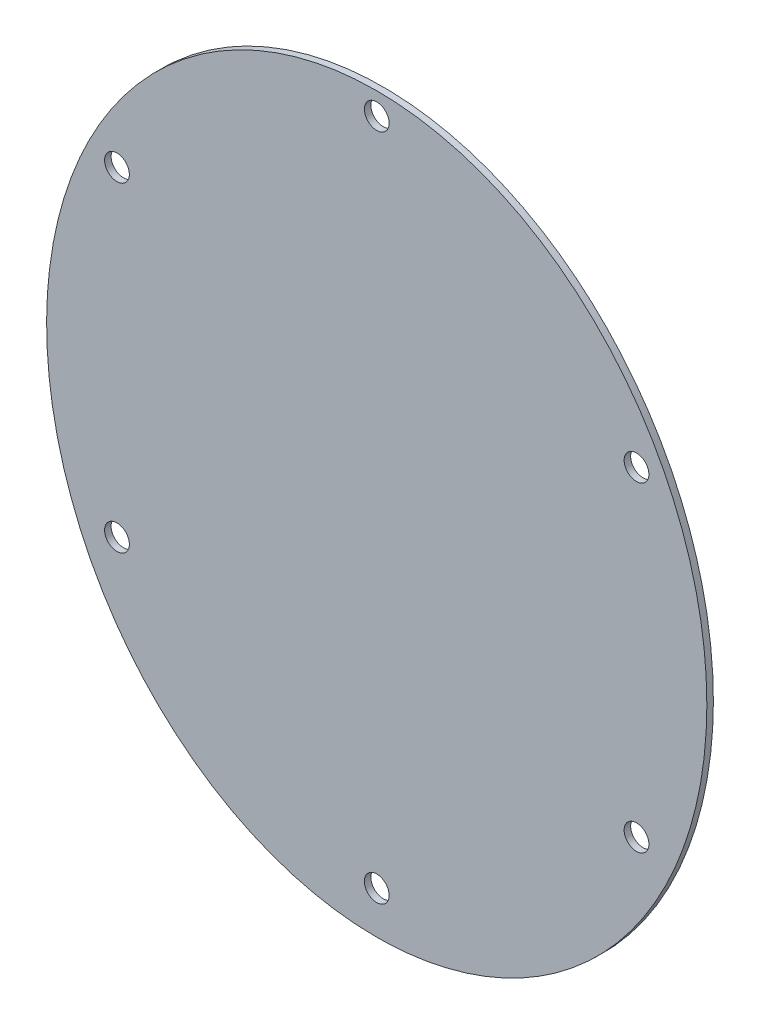
ISO-10303-21;
HEADER;
FILE_DESCRIPTION(('STEP AP214'),'2;1');
FILE_NAME('part.step','',(''),(''),'','','');
FILE_SCHEMA(('AUTOMOTIVE_DESIGN { 1 0 10303 214 1 1 1 1 }'));
ENDSEC;
DATA;
#1=APPLICATION_CONTEXT('core data for automotive mechanical design processes');
#2=APPLICATION_PROTOCOL_DEFINITION('international standard','automotive_design',2000,#1);
#3=PRODUCT_CONTEXT('',#1,'mechanical');
#4=PRODUCT('Part','Part','',(#3));
#5=PRODUCT_RELATED_PRODUCT_CATEGORY('part','',(#4));
#6=PRODUCT_DEFINITION_FORMATION('','',#4);
#7=PRODUCT_DEFINITION_CONTEXT('part definition',#1,'design');
#8=PRODUCT_DEFINITION('design','',#6,#7);
#9=PRODUCT_DEFINITION_SHAPE('','',#8);
#10=(LENGTH_UNIT() NAMED_UNIT(*) SI_UNIT(.MILLI.,.METRE.));
#11=(NAMED_UNIT(*) PLANE_ANGLE_UNIT() SI_UNIT($,.RADIAN.));
#12=(NAMED_UNIT(*) SI_UNIT($,.STERADIAN.) SOLID_ANGLE_UNIT());
#13=UNCERTAINTY_MEASURE_WITH_UNIT(LENGTH_MEASURE(1.E-05),#10,'distance_accuracy_value','');
#14=(GEOMETRIC_REPRESENTATION_CONTEXT(3) GLOBAL_UNCERTAINTY_ASSIGNED_CONTEXT((#13)) GLOBAL_UNIT_ASSIGNED_CONTEXT((#10,
#11,#12)) REPRESENTATION_CONTEXT('',''));
#15=CARTESIAN_POINT('',(0.,0.,0.));
#16=DIRECTION('',(0.,0.,1.));
#17=DIRECTION('',(1.,0.,0.));
#18=AXIS2_PLACEMENT_3D('',#15,#16,#17);
#19=CARTESIAN_POINT('',(0.196552246439251,52.9202516701964,1.));
#20=DIRECTION('',(0.,0.,-1.));
#21=DIRECTION('',(-1.,0.,0.));
#22=AXIS2_PLACEMENT_3D('',#19,#20,#21);
#23=PLANE('',#22);
#24=CARTESIAN_POINT('',(39.8371685740842,22.8280933576828,1.));
#25=DIRECTION('',(0.,0.,1.));
#26=DIRECTION('',(1.,0.,0.));
#27=AXIS2_PLACEMENT_3D('',#24,#25,#26);
#28=CIRCLE('',#27,1.89864999999999);
#29=CARTESIAN_POINT('',(41.7358185740842,22.8280933576828,1.));
#30=VERTEX_POINT('',#29);
#31=EDGE_CURVE('E77',#30,#30,#28,.T.);
#32=ORIENTED_EDGE('',*,*,#31,.F.);
#33=EDGE_LOOP('',(#32));
#34=FACE_BOUND('',#33,.T.);
#35=CARTESIAN_POINT('',(-39.8371685740842,-26.2921949728195,1.));
#36=DIRECTION('',(0.,0.,1.));
#37=DIRECTION('',(1.,0.,0.));
#38=AXIS2_PLACEMENT_3D('',#35,#36,#37);
#39=CIRCLE('',#38,1.89864999999999);
#40=CARTESIAN_POINT('',(-37.9385185740842,-26.2921949728195,1.));
#41=VERTEX_POINT('',#40);
#42=EDGE_CURVE('E71',#41,#41,#39,.T.);
#43=ORIENTED_EDGE('',*,*,#42,.F.);
#44=EDGE_LOOP('',(#43));
#45=FACE_BOUND('',#44,.T.);
#46=CARTESIAN_POINT('',(39.8371685740842,-26.2921949728195,1.));
#47=DIRECTION('',(0.,0.,1.));
#48=DIRECTION('',(1.,0.,0.));
#49=AXIS2_PLACEMENT_3D('',#46,#47,#48);
#50=CIRCLE('',#49,1.89864999999999);
#51=CARTESIAN_POINT('',(41.7358185740842,-26.2921949728195,1.));
#52=VERTEX_POINT('',#51);
#53=EDGE_CURVE('E53',#52,#52,#50,.T.);
#54=ORIENTED_EDGE('',*,*,#53,.F.);
#55=EDGE_LOOP('',(#54));
#56=FACE_BOUND('',#55,.T.);
#57=CARTESIAN_POINT('',(-0.0982194783628874,-59.5049604957268,1.));
#58=CARTESIAN_POINT('',(-0.981998738313389,-59.5030569990498,1.));
#59=CARTESIAN_POINT('',(-1.86634986060419,-59.4753922800616,1.));
#60=CARTESIAN_POINT('',(-3.62681671010795,-59.3691952722465,1.));
#61=CARTESIAN_POINT('',(-4.50450795032884,-59.290677090925,1.));
#62=CARTESIAN_POINT('',(-6.25482812899365,-59.0830220274894,1.));
#63=CARTESIAN_POINT('',(-7.12746263210783,-58.9539407873324,1.));
#64=CARTESIAN_POINT('',(-8.86764039021307,-58.6448701674466,1.));
#65=CARTESIAN_POINT('',(-9.73556333289851,-58.4646041765763,1.));
#66=CARTESIAN_POINT('',(-14.0154658104592,-57.4481518059426,1.));
#67=CARTESIAN_POINT('',(-17.288093173818,-56.262961800742,1.));
#68=CARTESIAN_POINT('',(-21.9851942406638,-53.9642697896704,1.));
#69=CARTESIAN_POINT('',(-23.5152979816951,-53.1105083048384,1.));
#70=CARTESIAN_POINT('',(-25.756352373327,-51.6968330940162,1.));
#71=CARTESIAN_POINT('',(-26.4907922652201,-51.2055327801085,1.));
#72=CARTESIAN_POINT('',(-27.9238784274983,-50.1915506671955,1.));
#73=CARTESIAN_POINT('',(-28.6243327805825,-49.6677443153114,1.));
#74=CARTESIAN_POINT('',(-32.0492001655399,-46.9678125916154,1.));
#75=CARTESIAN_POINT('',(-34.5429929574581,-44.5506521638814,1.));
#76=CARTESIAN_POINT('',(-37.3706227393272,-41.2265115715833,1.));
#77=CARTESIAN_POINT('',(-37.9216551403641,-40.5465353684551,1.));
#78=CARTESIAN_POINT('',(-38.9942939981493,-39.1558281415093,1.));
#79=CARTESIAN_POINT('',(-39.517329036837,-38.4429985741316,1.));
#80=CARTESIAN_POINT('',(-41.0299763641037,-36.2747833846186,1.));
#81=CARTESIAN_POINT('',(-41.961585356867,-34.7931027323144,1.));
#82=CARTESIAN_POINT('',(-44.5430336281085,-30.2475026475218,1.));
#83=CARTESIAN_POINT('',(-45.9788320828827,-27.0827130540914,1.));
#84=CARTESIAN_POINT('',(-47.4307614134011,-22.9651672499587,1.));
#85=CARTESIAN_POINT('',(-47.7039900602166,-22.1335724751779,1.));
#86=CARTESIAN_POINT('',(-48.2155234401069,-20.4539244727905,1.));
#87=CARTESIAN_POINT('',(-48.4543439746006,-19.6037807053056,1.));
#88=CARTESIAN_POINT('',(-49.1132846073318,-17.0451368459971,1.));
#89=CARTESIAN_POINT('',(-49.4755293351638,-15.3318792208717,1.));
#90=CARTESIAN_POINT('',(-50.3434105505474,-10.1708171159133,1.));
#91=CARTESIAN_POINT('',(-50.6298168488829,-6.70168671178589,1.));
#92=CARTESIAN_POINT('',(-50.6237192594074,-2.32985483683514,1.));
#93=CARTESIAN_POINT('',(-50.6042829587259,-1.45371639873644,1.));
#94=CARTESIAN_POINT('',(-50.5280352214342,0.302196196255699,1.));
#95=CARTESIAN_POINT('',(-50.4710144819888,1.1839035456081,1.));
#96=CARTESIAN_POINT('',(-50.2444494204728,3.81407138007278,1.));
#97=CARTESIAN_POINT('',(-50.0196653976059,5.55068754078175,1.));
#98=CARTESIAN_POINT('',(-49.1306266547464,10.7115403131951,1.));
#99=CARTESIAN_POINT('',(-48.2516563669417,14.0867746211106,1.));
#100=CARTESIAN_POINT('',(-46.778638511939,18.2203937648498,1.));
#101=CARTESIAN_POINT('',(-46.4649461534013,19.0437465171968,1.));
#102=CARTESIAN_POINT('',(-45.800228368791,20.6776739457141,1.));
#103=CARTESIAN_POINT('',(-45.450758836788,21.4845347087371,1.));
#104=CARTESIAN_POINT('',(-44.3511443737399,23.8748825713436,1.));
#105=CARTESIAN_POINT('',(-43.549814587595,25.4281476509321,1.));
#106=CARTESIAN_POINT('',(-41.8112635110826,28.4544408777245,1.));
#107=CARTESIAN_POINT('',(-40.8735804401836,29.9271963673146,1.));
#108=CARTESIAN_POINT('',(-39.3606008831212,32.0734734376496,1.));
#109=CARTESIAN_POINT('',(-38.8385265001374,32.7784199284256,1.));
#110=CARTESIAN_POINT('',(-37.7576893443596,34.1666503059072,1.));
#111=CARTESIAN_POINT('',(-37.1975573057276,34.8514144410357,1.));
#112=CARTESIAN_POINT('',(-34.3281173711102,38.1900174164105,1.));
#113=CARTESIAN_POINT('',(-31.8037705351297,40.6051524363194,1.));
#114=CARTESIAN_POINT('',(-28.3500825805673,43.2906818660675,1.));
#115=CARTESIAN_POINT('',(-27.6444135934269,43.8110974089729,1.));
#116=CARTESIAN_POINT('',(-26.2019854388351,44.8171758322216,1.));
#117=CARTESIAN_POINT('',(-25.4630587354175,45.3041367937578,1.));
#118=CARTESIAN_POINT('',(-23.216502951169,46.6992474237129,1.));
#119=CARTESIAN_POINT('',(-21.6803814947876,47.5416966522648,1.));
#120=CARTESIAN_POINT('',(-18.5325191948517,49.0541191393482,1.));
#121=CARTESIAN_POINT('',(-16.9204920935826,49.7234394888991,1.));
#122=CARTESIAN_POINT('',(-14.443658357936,50.5933222040772,1.));
#123=CARTESIAN_POINT('',(-13.6082403445222,50.8609154079295,1.));
#124=CARTESIAN_POINT('',(-11.9171862910726,51.3499876657593,1.));
#125=CARTESIAN_POINT('',(-11.0590696388131,51.5719092366827,1.));
#126=CARTESIAN_POINT('',(-6.76618264130519,52.5524505528677,1.));
#127=CARTESIAN_POINT('',(-3.30040950345272,52.9353591051738,1.));
#128=CARTESIAN_POINT('',(1.07079268391354,52.916474811452,1.));
#129=CARTESIAN_POINT('',(1.94700105264653,52.8875840392633,1.));
#130=CARTESIAN_POINT('',(3.70342985099483,52.7786022564443,1.));
#131=CARTESIAN_POINT('',(4.58641566064538,52.6980755168104,1.));
#132=CARTESIAN_POINT('',(7.2090323321715,52.3821961610154,1.));
#133=CARTESIAN_POINT('',(8.92900103697104,52.0729347998065,1.));
#134=CARTESIAN_POINT('',(14.0076529796143,50.8632559821896,1.));
#135=CARTESIAN_POINT('',(17.2856616260946,49.6829545274485,1.));
#136=CARTESIAN_POINT('',(21.2483052966462,47.7396837530319,1.));
#137=CARTESIAN_POINT('',(22.0296917577828,47.3294266081719,1.));
#138=CARTESIAN_POINT('',(23.5597617654625,46.4727965382526,1.));
#139=CARTESIAN_POINT('',(24.3102383577723,46.0255816956462,1.));
#140=CARTESIAN_POINT('',(26.5194649979632,44.6291488301847,1.));
#141=CARTESIAN_POINT('',(27.9361152941338,43.625276684683,1.));
#142=CARTESIAN_POINT('',(30.661776584017,41.4777944760171,1.));
#143=CARTESIAN_POINT('',(31.9710960907075,40.3345849260496,1.));
#144=CARTESIAN_POINT('',(33.8546150439909,38.515316600902,1.));
#145=CARTESIAN_POINT('',(34.4690463585147,37.8914870516643,1.));
#146=CARTESIAN_POINT('',(35.6710808868664,36.6089995694993,1.));
#147=CARTESIAN_POINT('',(36.2599660586775,35.9487338884862,1.));
#148=CARTESIAN_POINT('',(39.1052545708694,32.5990552740755,1.));
#149=CARTESIAN_POINT('',(41.0880113623615,29.7424096421019,1.));
#150=CARTESIAN_POINT('',(43.6622150282065,25.2163671033447,1.));
#151=CARTESIAN_POINT('',(44.4534607316479,23.667406617519,1.));
#152=CARTESIAN_POINT('',(45.5392896590853,21.2830603709974,1.));
#153=CARTESIAN_POINT('',(45.8843936621295,20.4781279509958,1.));
#154=CARTESIAN_POINT('',(46.5408010808128,18.847888508239,1.));
#155=CARTESIAN_POINT('',(46.8524749567324,18.0213182474084,1.));
#156=CARTESIAN_POINT('',(48.3119971283412,13.8793466062706,1.));
#157=CARTESIAN_POINT('',(49.176634832998,10.5068772719212,1.));
#158=CARTESIAN_POINT('',(50.0458077103774,5.36502242572939,1.));
#159=CARTESIAN_POINT('',(50.3733348904663,2.77328526115309,1.));
#160=CARTESIAN_POINT('',(50.5366248497832,0.149624336311633,1.));
#161=CARTESIAN_POINT('',(50.6085727791165,-1.60665775919957,1.));
#162=CARTESIAN_POINT('',(50.6260131792424,-2.48928209760767,1.));
#163=CARTESIAN_POINT('',(50.6207204132577,-6.8803305359242,1.));
#164=CARTESIAN_POINT('',(50.3226135593932,-10.3532883088535,1.));
#165=CARTESIAN_POINT('',(49.4412860278118,-15.5038048374262,1.));
#166=CARTESIAN_POINT('',(49.0751992531057,-17.2108304815739,1.));
#167=CARTESIAN_POINT('',(48.1916150536774,-20.6043340770379,1.));
#168=CARTESIAN_POINT('',(47.6718392005724,-22.2954018489782,1.));
#169=CARTESIAN_POINT('',(45.9095373095687,-27.2493140698196,1.));
#170=CARTESIAN_POINT('',(44.458849610806,-30.4199063445972,1.));
#171=CARTESIAN_POINT('',(42.2877084929261,-34.2119014002901,1.));
#172=CARTESIAN_POINT('',(41.8354756972371,-34.9616828664162,1.));
#173=CARTESIAN_POINT('',(40.8938757154886,-36.4434721310403,1.));
#174=CARTESIAN_POINT('',(40.4033722105771,-37.1770662930733,1.));
#175=CARTESIAN_POINT('',(38.8830321680465,-39.3382830036403,1.));
#176=CARTESIAN_POINT('',(37.808190416851,-40.7216262544268,1.));
#177=CARTESIAN_POINT('',(34.399299566617,-44.6987642984388,1.));
#178=CARTESIAN_POINT('',(31.882951556532,-47.1216054499118,1.));
#179=CARTESIAN_POINT('',(26.3140730080597,-51.4644742399791,1.));
#180=CARTESIAN_POINT('',(23.3506106315552,-53.314567678357,1.));
#181=CARTESIAN_POINT('',(18.6346129273404,-55.5937643109684,1.));
#182=CARTESIAN_POINT('',(17.016960529783,-56.2704381322972,1.));
#183=CARTESIAN_POINT('',(13.6847994060173,-57.4475716820438,1.));
#184=CARTESIAN_POINT('',(12.0016357601053,-57.9369218991718,1.));
#185=CARTESIAN_POINT('',(6.90238557380206,-59.113542237342,1.));
#186=CARTESIAN_POINT('',(3.43689756143903,-59.512574482435,1.));
#187=CARTESIAN_POINT('',(-0.0982194783628874,-59.5049604957268,1.));
#188=B_SPLINE_CURVE_WITH_KNOTS('',3,(#57,#58,#59,#60,#61,#62,#63,#64,#65,#66,#67,#68,#69,#70,
#71,#72,#73,#74,#75,#76,#77,#78,#79,#80,#81,#82,#83,#84,#85,#86,#87,#88,#89,#90,#91,#92,#93,#94,
#95,#96,#97,#98,#99,#100,#101,#102,#103,#104,#105,#106,#107,#108,#109,#110,#111,#112,#113,#114,
#115,#116,#117,#118,#119,#120,#121,#122,#123,#124,#125,#126,#127,#128,#129,#130,#131,#132,#133,
#134,#135,#136,#137,#138,#139,#140,#141,#142,#143,#144,#145,#146,#147,#148,#149,#150,#151,#152,
#153,#154,#155,#156,#157,#158,#159,#160,#161,#162,#163,#164,#165,#166,#167,#168,#169,#170,#171,
#172,#173,#174,#175,#176,#177,#178,#179,#180,#181,#182,#183,#184,#185,#186,#187),.UNSPECIFIED.,
.T.,.F.,(4,2,2,2,2,2,2,2,2,2,2,2,2,2,2,2,2,2,2,2,2,2,2,2,2,2,2,2,2,2,2,2,2,2,2,2,2,2,2,2,2,2,2,
2,2,2,2,2,2,2,2,1,2,2,2,2,2,2,2,2,2,2,2,2,2,4),(0.,0.00781250000000011,0.0156250000000002,
0.0234375000000004,0.0312500000000006,0.062500000000001,0.0781250000000011,0.0859375000000012,
0.0937500000000014,0.125000000000002,0.132812500000002,0.140625000000002,0.156250000000002,
0.187500000000002,0.195312500000002,0.203125000000002,0.218750000000002,0.250000000000002,
0.257812500000002,0.265625000000002,0.281250000000002,0.312500000000003,0.320312500000003,
0.328125000000003,0.343750000000003,0.359375000000003,0.367187500000003,0.375000000000003,
0.406250000000003,0.414062500000003,0.421875000000003,0.437500000000003,0.453125000000003,
0.460937500000003,0.468750000000003,0.500000000000003,0.507812500000003,0.515625000000003,
0.531250000000003,0.562500000000003,0.570312500000003,0.578125000000003,0.593750000000003,
0.609375000000003,0.617187500000003,0.625000000000003,0.656250000000003,0.671875000000003,
0.679687500000003,0.687500000000003,0.718750000000002,0.734375000000002,0.742187500000002,
0.750000000000002,0.781250000000002,0.796875000000002,0.812500000000002,0.843750000000002,
0.851562500000002,0.859375000000002,0.875000000000001,0.906250000000001,0.937500000000001,
0.953125000000001,0.96875,1.),.UNSPECIFIED.);
#189=CARTESIAN_POINT('',(-0.0982194783628874,-59.5049604957268,1.));
#190=VERTEX_POINT('',#189);
#191=EDGE_CURVE('E10',#190,#190,#188,.F.);
#192=ORIENTED_EDGE('',*,*,#191,.T.);
#193=EDGE_LOOP('',(#192));
#194=FACE_BOUND('',#193,.T.);
#195=CARTESIAN_POINT('',(0.,-53.,1.));
#196=DIRECTION('',(0.,0.,1.));
#197=DIRECTION('',(1.,0.,0.));
#198=AXIS2_PLACEMENT_3D('',#195,#196,#197);
#199=CIRCLE('',#198,1.89864999999999);
#200=CARTESIAN_POINT('',(1.89864999999999,-53.,1.));
#201=VERTEX_POINT('',#200);
#202=EDGE_CURVE('E67',#201,#201,#199,.T.);
#203=ORIENTED_EDGE('',*,*,#202,.F.);
#204=EDGE_LOOP('',(#203));
#205=FACE_BOUND('',#204,.T.);
#206=CARTESIAN_POINT('',(-39.8371685740842,22.8280933576828,1.));
#207=DIRECTION('',(0.,0.,1.));
#208=DIRECTION('',(1.,0.,0.));
#209=AXIS2_PLACEMENT_3D('',#206,#207,#208);
#210=CIRCLE('',#209,1.89864999999999);
#211=CARTESIAN_POINT('',(-37.9385185740842,22.8280933576828,1.));
#212=VERTEX_POINT('',#211);
#213=EDGE_CURVE('E74',#212,#212,#210,.T.);
#214=ORIENTED_EDGE('',*,*,#213,.F.);
#215=EDGE_LOOP('',(#214));
#216=FACE_BOUND('',#215,.T.);
#217=CARTESIAN_POINT('',(0.,49.5358983848623,1.));
#218=DIRECTION('',(0.,0.,1.));
#219=DIRECTION('',(1.,0.,0.));
#220=AXIS2_PLACEMENT_3D('',#217,#218,#219);
#221=CIRCLE('',#220,1.89864999999999);
#222=CARTESIAN_POINT('',(1.89864999999999,49.5358983848623,1.));
#223=VERTEX_POINT('',#222);
#224=EDGE_CURVE('E87',#223,#223,#221,.T.);
#225=ORIENTED_EDGE('',*,*,#224,.F.);
#226=EDGE_LOOP('',(#225));
#227=FACE_BOUND('',#226,.T.);
#228=ADVANCED_FACE('F33',(#34,#45,#56,#194,#205,#216,#227),#23,.F.);
#229=CARTESIAN_POINT('',(-0.0982194783628874,-59.5049604957268,1.));
#230=CARTESIAN_POINT('',(3.43689756143903,-59.512574482435,1.));
#231=CARTESIAN_POINT('',(6.90238557380206,-59.113542237342,1.));
#232=CARTESIAN_POINT('',(12.0016357601053,-57.9369218991718,1.));
#233=CARTESIAN_POINT('',(13.6847994060173,-57.4475716820438,1.));
#234=CARTESIAN_POINT('',(17.016960529783,-56.2704381322972,1.));
#235=CARTESIAN_POINT('',(18.6346129273404,-55.5937643109684,1.));
#236=CARTESIAN_POINT('',(23.3506106315552,-53.314567678357,1.));
#237=CARTESIAN_POINT('',(26.3140730080597,-51.4644742399791,1.));
#238=CARTESIAN_POINT('',(31.882951556532,-47.1216054499118,1.));
#239=CARTESIAN_POINT('',(34.399299566617,-44.6987642984388,1.));
#240=CARTESIAN_POINT('',(37.808190416851,-40.7216262544268,1.));
#241=CARTESIAN_POINT('',(38.8830321680465,-39.3382830036403,1.));
#242=CARTESIAN_POINT('',(40.4033722105771,-37.1770662930733,1.));
#243=CARTESIAN_POINT('',(40.8938757154886,-36.4434721310403,1.));
#244=CARTESIAN_POINT('',(41.8354756972371,-34.9616828664162,1.));
#245=CARTESIAN_POINT('',(42.2877084929261,-34.2119014002901,1.));
#246=CARTESIAN_POINT('',(44.458849610806,-30.4199063445972,1.));
#247=CARTESIAN_POINT('',(45.9095373095687,-27.2493140698196,1.));
#248=CARTESIAN_POINT('',(47.6718392005724,-22.2954018489782,1.));
#249=CARTESIAN_POINT('',(48.1916150536774,-20.6043340770379,1.));
#250=CARTESIAN_POINT('',(49.0751992531057,-17.2108304815739,1.));
#251=CARTESIAN_POINT('',(49.4412860278118,-15.5038048374262,1.));
#252=CARTESIAN_POINT('',(50.3226135593932,-10.3532883088535,1.));
#253=CARTESIAN_POINT('',(50.6207204132577,-6.8803305359242,1.));
#254=CARTESIAN_POINT('',(50.6260131792424,-2.48928209760767,1.));
#255=CARTESIAN_POINT('',(50.6085727791165,-1.60665775919957,1.));
#256=CARTESIAN_POINT('',(50.5366248497832,0.149624336311633,1.));
#257=CARTESIAN_POINT('',(50.3733348904663,2.77328526115309,1.));
#258=CARTESIAN_POINT('',(50.0458077103774,5.36502242572939,1.));
#259=CARTESIAN_POINT('',(49.176634832998,10.5068772719212,1.));
#260=CARTESIAN_POINT('',(48.3119971283412,13.8793466062706,1.));
#261=CARTESIAN_POINT('',(46.8524749567324,18.0213182474084,1.));
#262=CARTESIAN_POINT('',(46.5408010808128,18.847888508239,1.));
#263=CARTESIAN_POINT('',(45.8843936621295,20.4781279509958,1.));
#264=CARTESIAN_POINT('',(45.5392896590853,21.2830603709974,1.));
#265=CARTESIAN_POINT('',(44.4534607316479,23.667406617519,1.));
#266=CARTESIAN_POINT('',(43.6622150282065,25.2163671033447,1.));
#267=CARTESIAN_POINT('',(41.0880113623615,29.7424096421019,1.));
#268=CARTESIAN_POINT('',(39.1052545708694,32.5990552740755,1.));
#269=CARTESIAN_POINT('',(36.2599660586775,35.9487338884862,1.));
#270=CARTESIAN_POINT('',(35.6710808868664,36.6089995694993,1.));
#271=CARTESIAN_POINT('',(34.4690463585147,37.8914870516643,1.));
#272=CARTESIAN_POINT('',(33.8546150439909,38.515316600902,1.));
#273=CARTESIAN_POINT('',(31.9710960907075,40.3345849260496,1.));
#274=CARTESIAN_POINT('',(30.661776584017,41.4777944760171,1.));
#275=CARTESIAN_POINT('',(27.9361152941338,43.625276684683,1.));
#276=CARTESIAN_POINT('',(26.5194649979632,44.6291488301847,1.));
#277=CARTESIAN_POINT('',(24.3102383577723,46.0255816956462,1.));
#278=CARTESIAN_POINT('',(23.5597617654625,46.4727965382526,1.));
#279=CARTESIAN_POINT('',(22.0296917577828,47.3294266081719,1.));
#280=CARTESIAN_POINT('',(21.2483052966462,47.7396837530319,1.));
#281=CARTESIAN_POINT('',(17.2856616260946,49.6829545274485,1.));
#282=CARTESIAN_POINT('',(14.0076529796143,50.8632559821896,1.));
#283=CARTESIAN_POINT('',(8.92900103697104,52.0729347998065,1.));
#284=CARTESIAN_POINT('',(7.2090323321715,52.3821961610154,1.));
#285=CARTESIAN_POINT('',(4.58641566064538,52.6980755168104,1.));
#286=CARTESIAN_POINT('',(3.70342985099483,52.7786022564443,1.));
#287=CARTESIAN_POINT('',(1.94700105264653,52.8875840392633,1.));
#288=CARTESIAN_POINT('',(1.07079268391354,52.916474811452,1.));
#289=CARTESIAN_POINT('',(-3.30040950345272,52.9353591051738,1.));
#290=CARTESIAN_POINT('',(-6.76618264130519,52.5524505528677,1.));
#291=CARTESIAN_POINT('',(-11.0590696388131,51.5719092366827,1.));
#292=CARTESIAN_POINT('',(-11.9171862910726,51.3499876657593,1.));
#293=CARTESIAN_POINT('',(-13.6082403445222,50.8609154079295,1.));
#294=CARTESIAN_POINT('',(-14.443658357936,50.5933222040772,1.));
#295=CARTESIAN_POINT('',(-16.9204920935826,49.7234394888991,1.));
#296=CARTESIAN_POINT('',(-18.5325191948517,49.0541191393482,1.));
#297=CARTESIAN_POINT('',(-21.6803814947876,47.5416966522648,1.));
#298=CARTESIAN_POINT('',(-23.216502951169,46.6992474237129,1.));
#299=CARTESIAN_POINT('',(-25.4630587354175,45.3041367937578,1.));
#300=CARTESIAN_POINT('',(-26.2019854388351,44.8171758322216,1.));
#301=CARTESIAN_POINT('',(-27.6444135934269,43.8110974089729,1.));
#302=CARTESIAN_POINT('',(-28.3500825805673,43.2906818660675,1.));
#303=CARTESIAN_POINT('',(-31.8037705351297,40.6051524363194,1.));
#304=CARTESIAN_POINT('',(-34.3281173711102,38.1900174164105,1.));
#305=CARTESIAN_POINT('',(-37.1975573057276,34.8514144410357,1.));
#306=CARTESIAN_POINT('',(-37.7576893443596,34.1666503059072,1.));
#307=CARTESIAN_POINT('',(-38.8385265001374,32.7784199284256,1.));
#308=CARTESIAN_POINT('',(-39.3606008831212,32.0734734376496,1.));
#309=CARTESIAN_POINT('',(-40.8735804401836,29.9271963673146,1.));
#310=CARTESIAN_POINT('',(-41.8112635110826,28.4544408777245,1.));
#311=CARTESIAN_POINT('',(-43.549814587595,25.4281476509321,1.));
#312=CARTESIAN_POINT('',(-44.3511443737399,23.8748825713436,1.));
#313=CARTESIAN_POINT('',(-45.450758836788,21.4845347087371,1.));
#314=CARTESIAN_POINT('',(-45.800228368791,20.6776739457141,1.));
#315=CARTESIAN_POINT('',(-46.4649461534013,19.0437465171968,1.));
#316=CARTESIAN_POINT('',(-46.778638511939,18.2203937648498,1.));
#317=CARTESIAN_POINT('',(-48.2516563669417,14.0867746211106,1.));
#318=CARTESIAN_POINT('',(-49.1306266547464,10.7115403131951,1.));
#319=CARTESIAN_POINT('',(-50.0196653976059,5.55068754078175,1.));
#320=CARTESIAN_POINT('',(-50.2444494204728,3.81407138007278,1.));
#321=CARTESIAN_POINT('',(-50.4710144819888,1.1839035456081,1.));
#322=CARTESIAN_POINT('',(-50.5280352214342,0.302196196255699,1.));
#323=CARTESIAN_POINT('',(-50.6042829587259,-1.45371639873644,1.));
#324=CARTESIAN_POINT('',(-50.6237192594074,-2.32985483683514,1.));
#325=CARTESIAN_POINT('',(-50.6298168488829,-6.70168671178589,1.));
#326=CARTESIAN_POINT('',(-50.3434105505474,-10.1708171159133,1.));
#327=CARTESIAN_POINT('',(-49.4755293351638,-15.3318792208717,1.));
#328=CARTESIAN_POINT('',(-49.1132846073318,-17.0451368459971,1.));
#329=CARTESIAN_POINT('',(-48.4543439746006,-19.6037807053056,1.));
#330=CARTESIAN_POINT('',(-48.2155234401069,-20.4539244727905,1.));
#331=CARTESIAN_POINT('',(-47.7039900602166,-22.1335724751779,1.));
#332=CARTESIAN_POINT('',(-47.4307614134011,-22.9651672499587,1.));
#333=CARTESIAN_POINT('',(-45.9788320828827,-27.0827130540914,1.));
#334=CARTESIAN_POINT('',(-44.5430336281085,-30.2475026475218,1.));
#335=CARTESIAN_POINT('',(-41.961585356867,-34.7931027323144,1.));
#336=CARTESIAN_POINT('',(-41.0299763641037,-36.2747833846186,1.));
#337=CARTESIAN_POINT('',(-39.517329036837,-38.4429985741316,1.));
#338=CARTESIAN_POINT('',(-38.9942939981493,-39.1558281415093,1.));
#339=CARTESIAN_POINT('',(-37.9216551403641,-40.5465353684551,1.));
#340=CARTESIAN_POINT('',(-37.3706227393272,-41.2265115715833,1.));
#341=CARTESIAN_POINT('',(-34.5429929574581,-44.5506521638814,1.));
#342=CARTESIAN_POINT('',(-32.0492001655399,-46.9678125916154,1.));
#343=CARTESIAN_POINT('',(-28.6243327805825,-49.6677443153114,1.));
#344=CARTESIAN_POINT('',(-27.9238784274983,-50.1915506671955,1.));
#345=CARTESIAN_POINT('',(-26.4907922652201,-51.2055327801085,1.));
#346=CARTESIAN_POINT('',(-25.756352373327,-51.6968330940162,1.));
#347=CARTESIAN_POINT('',(-23.5152979816951,-53.1105083048384,1.));
#348=CARTESIAN_POINT('',(-21.9851942406638,-53.9642697896704,1.));
#349=CARTESIAN_POINT('',(-17.288093173818,-56.262961800742,1.));
#350=CARTESIAN_POINT('',(-14.0154658104592,-57.4481518059426,1.));
#351=CARTESIAN_POINT('',(-9.73556333289851,-58.4646041765763,1.));
#352=CARTESIAN_POINT('',(-8.86764039021307,-58.6448701674466,1.));
#353=CARTESIAN_POINT('',(-7.12746263210783,-58.9539407873324,1.));
#354=CARTESIAN_POINT('',(-6.25482812899365,-59.0830220274894,1.));
#355=CARTESIAN_POINT('',(-4.50450795032884,-59.290677090925,1.));
#356=CARTESIAN_POINT('',(-3.62681671010795,-59.3691952722465,1.));
#357=CARTESIAN_POINT('',(-1.86634986060419,-59.4753922800616,1.));
#358=CARTESIAN_POINT('',(-0.981998738313389,-59.5030569990498,1.));
#359=CARTESIAN_POINT('',(-0.0982194783628874,-59.5049604957268,1.));
#360=B_SPLINE_CURVE_WITH_KNOTS('',3,(#229,#230,#231,#232,#233,#234,#235,#236,#237,#238,#239,
#240,#241,#242,#243,#244,#245,#246,#247,#248,#249,#250,#251,#252,#253,#254,#255,#256,#257,#258,
#259,#260,#261,#262,#263,#264,#265,#266,#267,#268,#269,#270,#271,#272,#273,#274,#275,#276,#277,
#278,#279,#280,#281,#282,#283,#284,#285,#286,#287,#288,#289,#290,#291,#292,#293,#294,#295,#296,
#297,#298,#299,#300,#301,#302,#303,#304,#305,#306,#307,#308,#309,#310,#311,#312,#313,#314,#315,
#316,#317,#318,#319,#320,#321,#322,#323,#324,#325,#326,#327,#328,#329,#330,#331,#332,#333,#334,
#335,#336,#337,#338,#339,#340,#341,#342,#343,#344,#345,#346,#347,#348,#349,#350,#351,#352,#353,
#354,#355,#356,#357,#358,#359),.UNSPECIFIED.,.T.,.F.,(4,2,2,2,2,2,2,2,2,2,2,2,2,2,1,2,2,2,2,2,2,
2,2,2,2,2,2,2,2,2,2,2,2,2,2,2,2,2,2,2,2,2,2,2,2,2,2,2,2,2,2,2,2,2,2,2,2,2,2,2,2,2,2,2,2,4),(0.,
0.0312499999999997,0.0468749999999995,0.0624999999999993,0.093749999999999,0.124999999999999,
0.140624999999998,0.148437499999998,0.156249999999998,0.187499999999998,0.203124999999998,
0.218749999999998,0.249999999999998,0.257812499999998,0.265624999999998,0.281249999999998,
0.312499999999997,0.320312499999997,0.328124999999997,0.343749999999997,0.374999999999997,
0.382812499999997,0.390624999999997,0.406249999999997,0.421874999999997,0.429687499999997,
0.437499999999997,0.468749999999997,0.484374999999997,0.492187499999997,0.499999999999997,
0.531249999999997,0.539062499999997,0.546874999999997,0.562499999999997,0.578124999999997,
0.585937499999997,0.593749999999997,0.624999999999997,0.632812499999997,0.640624999999997,
0.656249999999997,0.671874999999997,0.679687499999997,0.687499999999997,0.718749999999998,
0.734374999999998,0.742187499999998,0.749999999999998,0.781249999999998,0.796874999999998,
0.804687499999998,0.812499999999998,0.843749999999998,0.859374999999998,0.867187499999998,
0.874999999999998,0.906249999999999,0.914062499999999,0.921874999999999,0.937499999999999,
0.968749999999999,0.9765625,0.984375,0.9921875,1.),.UNSPECIFIED.);
#361=DIRECTION('',(0.,0.,-1.));
#362=VECTOR('',#361,1.);
#363=SURFACE_OF_LINEAR_EXTRUSION('',#360,#362);
#364=ORIENTED_EDGE('',*,*,#191,.F.);
#365=EDGE_LOOP('',(#364));
#366=FACE_BOUND('',#365,.T.);
#367=CARTESIAN_POINT('',(-0.0982194783628874,-59.5049604957268,0.));
#368=CARTESIAN_POINT('',(3.43689756143903,-59.512574482435,0.));
#369=CARTESIAN_POINT('',(6.90238557380206,-59.113542237342,0.));
#370=CARTESIAN_POINT('',(12.0016357601053,-57.9369218991718,0.));
#371=CARTESIAN_POINT('',(13.6847994060173,-57.4475716820438,0.));
#372=CARTESIAN_POINT('',(17.016960529783,-56.2704381322972,0.));
#373=CARTESIAN_POINT('',(18.6346129273404,-55.5937643109684,0.));
#374=CARTESIAN_POINT('',(23.3506106315552,-53.314567678357,0.));
#375=CARTESIAN_POINT('',(26.3140730080597,-51.4644742399791,0.));
#376=CARTESIAN_POINT('',(31.882951556532,-47.1216054499118,0.));
#377=CARTESIAN_POINT('',(34.399299566617,-44.6987642984388,0.));
#378=CARTESIAN_POINT('',(37.808190416851,-40.7216262544268,0.));
#379=CARTESIAN_POINT('',(38.8830321680465,-39.3382830036403,0.));
#380=CARTESIAN_POINT('',(40.4033722105771,-37.1770662930733,0.));
#381=CARTESIAN_POINT('',(40.8938757154886,-36.4434721310403,0.));
#382=CARTESIAN_POINT('',(41.8354756972371,-34.9616828664162,0.));
#383=CARTESIAN_POINT('',(42.2877084929261,-34.2119014002901,0.));
#384=CARTESIAN_POINT('',(44.458849610806,-30.4199063445972,0.));
#385=CARTESIAN_POINT('',(45.9095373095687,-27.2493140698196,0.));
#386=CARTESIAN_POINT('',(47.6718392005724,-22.2954018489782,0.));
#387=CARTESIAN_POINT('',(48.1916150536774,-20.6043340770379,0.));
#388=CARTESIAN_POINT('',(49.0751992531057,-17.2108304815739,0.));
#389=CARTESIAN_POINT('',(49.4412860278118,-15.5038048374262,0.));
#390=CARTESIAN_POINT('',(50.3226135593932,-10.3532883088535,0.));
#391=CARTESIAN_POINT('',(50.6207204132577,-6.8803305359242,0.));
#392=CARTESIAN_POINT('',(50.6260131792424,-2.48928209760767,0.));
#393=CARTESIAN_POINT('',(50.6085727791165,-1.60665775919957,0.));
#394=CARTESIAN_POINT('',(50.5366248497832,0.149624336311633,0.));
#395=CARTESIAN_POINT('',(50.3733348904663,2.77328526115309,0.));
#396=CARTESIAN_POINT('',(50.0458077103774,5.36502242572939,0.));
#397=CARTESIAN_POINT('',(49.176634832998,10.5068772719212,0.));
#398=CARTESIAN_POINT('',(48.3119971283412,13.8793466062706,0.));
#399=CARTESIAN_POINT('',(46.8524749567324,18.0213182474084,0.));
#400=CARTESIAN_POINT('',(46.5408010808128,18.847888508239,0.));
#401=CARTESIAN_POINT('',(45.8843936621295,20.4781279509958,0.));
#402=CARTESIAN_POINT('',(45.5392896590853,21.2830603709974,0.));
#403=CARTESIAN_POINT('',(44.4534607316479,23.667406617519,0.));
#404=CARTESIAN_POINT('',(43.6622150282065,25.2163671033447,0.));
#405=CARTESIAN_POINT('',(41.0880113623615,29.7424096421019,0.));
#406=CARTESIAN_POINT('',(39.1052545708694,32.5990552740755,0.));
#407=CARTESIAN_POINT('',(36.2599660586775,35.9487338884862,0.));
#408=CARTESIAN_POINT('',(35.6710808868664,36.6089995694993,0.));
#409=CARTESIAN_POINT('',(34.4690463585147,37.8914870516643,0.));
#410=CARTESIAN_POINT('',(33.8546150439909,38.515316600902,0.));
#411=CARTESIAN_POINT('',(31.9710960907075,40.3345849260496,0.));
#412=CARTESIAN_POINT('',(30.661776584017,41.4777944760171,0.));
#413=CARTESIAN_POINT('',(27.9361152941338,43.625276684683,0.));
#414=CARTESIAN_POINT('',(26.5194649979632,44.6291488301847,0.));
#415=CARTESIAN_POINT('',(24.3102383577723,46.0255816956462,0.));
#416=CARTESIAN_POINT('',(23.5597617654625,46.4727965382526,0.));
#417=CARTESIAN_POINT('',(22.0296917577828,47.3294266081719,0.));
#418=CARTESIAN_POINT('',(21.2483052966462,47.7396837530319,0.));
#419=CARTESIAN_POINT('',(17.2856616260946,49.6829545274485,0.));
#420=CARTESIAN_POINT('',(14.0076529796143,50.8632559821896,0.));
#421=CARTESIAN_POINT('',(8.92900103697104,52.0729347998065,0.));
#422=CARTESIAN_POINT('',(7.2090323321715,52.3821961610154,0.));
#423=CARTESIAN_POINT('',(4.58641566064538,52.6980755168104,0.));
#424=CARTESIAN_POINT('',(3.70342985099483,52.7786022564443,0.));
#425=CARTESIAN_POINT('',(1.94700105264653,52.8875840392633,0.));
#426=CARTESIAN_POINT('',(1.07079268391354,52.916474811452,0.));
#427=CARTESIAN_POINT('',(-3.30040950345272,52.9353591051738,0.));
#428=CARTESIAN_POINT('',(-6.76618264130519,52.5524505528677,0.));
#429=CARTESIAN_POINT('',(-11.0590696388131,51.5719092366827,0.));
#430=CARTESIAN_POINT('',(-11.9171862910726,51.3499876657593,0.));
#431=CARTESIAN_POINT('',(-13.6082403445222,50.8609154079295,0.));
#432=CARTESIAN_POINT('',(-14.443658357936,50.5933222040772,0.));
#433=CARTESIAN_POINT('',(-16.9204920935826,49.7234394888991,0.));
#434=CARTESIAN_POINT('',(-18.5325191948517,49.0541191393482,0.));
#435=CARTESIAN_POINT('',(-21.6803814947876,47.5416966522648,0.));
#436=CARTESIAN_POINT('',(-23.216502951169,46.6992474237129,0.));
#437=CARTESIAN_POINT('',(-25.4630587354175,45.3041367937578,0.));
#438=CARTESIAN_POINT('',(-26.2019854388351,44.8171758322216,0.));
#439=CARTESIAN_POINT('',(-27.6444135934269,43.8110974089729,0.));
#440=CARTESIAN_POINT('',(-28.3500825805673,43.2906818660675,0.));
#441=CARTESIAN_POINT('',(-31.8037705351297,40.6051524363194,0.));
#442=CARTESIAN_POINT('',(-34.3281173711102,38.1900174164105,0.));
#443=CARTESIAN_POINT('',(-37.1975573057276,34.8514144410357,0.));
#444=CARTESIAN_POINT('',(-37.7576893443596,34.1666503059072,0.));
#445=CARTESIAN_POINT('',(-38.8385265001374,32.7784199284256,0.));
#446=CARTESIAN_POINT('',(-39.3606008831212,32.0734734376496,0.));
#447=CARTESIAN_POINT('',(-40.8735804401836,29.9271963673146,0.));
#448=CARTESIAN_POINT('',(-41.8112635110826,28.4544408777245,0.));
#449=CARTESIAN_POINT('',(-43.549814587595,25.4281476509321,0.));
#450=CARTESIAN_POINT('',(-44.3511443737399,23.8748825713436,0.));
#451=CARTESIAN_POINT('',(-45.450758836788,21.4845347087371,0.));
#452=CARTESIAN_POINT('',(-45.800228368791,20.6776739457141,0.));
#453=CARTESIAN_POINT('',(-46.4649461534013,19.0437465171968,0.));
#454=CARTESIAN_POINT('',(-46.778638511939,18.2203937648498,0.));
#455=CARTESIAN_POINT('',(-48.2516563669417,14.0867746211106,0.));
#456=CARTESIAN_POINT('',(-49.1306266547464,10.7115403131951,0.));
#457=CARTESIAN_POINT('',(-50.0196653976059,5.55068754078175,0.));
#458=CARTESIAN_POINT('',(-50.2444494204728,3.81407138007278,0.));
#459=CARTESIAN_POINT('',(-50.4710144819888,1.1839035456081,0.));
#460=CARTESIAN_POINT('',(-50.5280352214342,0.302196196255699,0.));
#461=CARTESIAN_POINT('',(-50.6042829587259,-1.45371639873644,0.));
#462=CARTESIAN_POINT('',(-50.6237192594074,-2.32985483683514,0.));
#463=CARTESIAN_POINT('',(-50.6298168488829,-6.70168671178589,0.));
#464=CARTESIAN_POINT('',(-50.3434105505474,-10.1708171159133,0.));
#465=CARTESIAN_POINT('',(-49.4755293351638,-15.3318792208717,0.));
#466=CARTESIAN_POINT('',(-49.1132846073318,-17.0451368459971,0.));
#467=CARTESIAN_POINT('',(-48.4543439746006,-19.6037807053056,0.));
#468=CARTESIAN_POINT('',(-48.2155234401069,-20.4539244727905,0.));
#469=CARTESIAN_POINT('',(-47.7039900602166,-22.1335724751779,0.));
#470=CARTESIAN_POINT('',(-47.4307614134011,-22.9651672499587,0.));
#471=CARTESIAN_POINT('',(-45.9788320828827,-27.0827130540914,0.));
#472=CARTESIAN_POINT('',(-44.5430336281085,-30.2475026475218,0.));
#473=CARTESIAN_POINT('',(-41.961585356867,-34.7931027323144,0.));
#474=CARTESIAN_POINT('',(-41.0299763641037,-36.2747833846186,0.));
#475=CARTESIAN_POINT('',(-39.517329036837,-38.4429985741316,0.));
#476=CARTESIAN_POINT('',(-38.9942939981493,-39.1558281415093,0.));
#477=CARTESIAN_POINT('',(-37.9216551403641,-40.5465353684551,0.));
#478=CARTESIAN_POINT('',(-37.3706227393272,-41.2265115715833,0.));
#479=CARTESIAN_POINT('',(-34.5429929574581,-44.5506521638814,0.));
#480=CARTESIAN_POINT('',(-32.0492001655399,-46.9678125916154,0.));
#481=CARTESIAN_POINT('',(-28.6243327805825,-49.6677443153114,0.));
#482=CARTESIAN_POINT('',(-27.9238784274983,-50.1915506671955,0.));
#483=CARTESIAN_POINT('',(-26.4907922652201,-51.2055327801085,0.));
#484=CARTESIAN_POINT('',(-25.756352373327,-51.6968330940162,0.));
#485=CARTESIAN_POINT('',(-23.5152979816951,-53.1105083048384,0.));
#486=CARTESIAN_POINT('',(-21.9851942406638,-53.9642697896704,0.));
#487=CARTESIAN_POINT('',(-17.288093173818,-56.262961800742,0.));
#488=CARTESIAN_POINT('',(-14.0154658104592,-57.4481518059426,0.));
#489=CARTESIAN_POINT('',(-9.73556333289851,-58.4646041765763,0.));
#490=CARTESIAN_POINT('',(-8.86764039021307,-58.6448701674466,0.));
#491=CARTESIAN_POINT('',(-7.12746263210783,-58.9539407873324,0.));
#492=CARTESIAN_POINT('',(-6.25482812899365,-59.0830220274894,0.));
#493=CARTESIAN_POINT('',(-4.50450795032884,-59.290677090925,0.));
#494=CARTESIAN_POINT('',(-3.62681671010795,-59.3691952722465,0.));
#495=CARTESIAN_POINT('',(-1.86634986060419,-59.4753922800616,0.));
#496=CARTESIAN_POINT('',(-0.981998738313389,-59.5030569990498,0.));
#497=CARTESIAN_POINT('',(-0.0982194783628874,-59.5049604957268,0.));
#498=B_SPLINE_CURVE_WITH_KNOTS('',3,(#367,#368,#369,#370,#371,#372,#373,#374,#375,#376,#377,
#378,#379,#380,#381,#382,#383,#384,#385,#386,#387,#388,#389,#390,#391,#392,#393,#394,#395,#396,
#397,#398,#399,#400,#401,#402,#403,#404,#405,#406,#407,#408,#409,#410,#411,#412,#413,#414,#415,
#416,#417,#418,#419,#420,#421,#422,#423,#424,#425,#426,#427,#428,#429,#430,#431,#432,#433,#434,
#435,#436,#437,#438,#439,#440,#441,#442,#443,#444,#445,#446,#447,#448,#449,#450,#451,#452,#453,
#454,#455,#456,#457,#458,#459,#460,#461,#462,#463,#464,#465,#466,#467,#468,#469,#470,#471,#472,
#473,#474,#475,#476,#477,#478,#479,#480,#481,#482,#483,#484,#485,#486,#487,#488,#489,#490,#491,
#492,#493,#494,#495,#496,#497),.UNSPECIFIED.,.T.,.F.,(4,2,2,2,2,2,2,2,2,2,2,2,2,2,1,2,2,2,2,2,2,
2,2,2,2,2,2,2,2,2,2,2,2,2,2,2,2,2,2,2,2,2,2,2,2,2,2,2,2,2,2,2,2,2,2,2,2,2,2,2,2,2,2,2,2,4),(0.,
0.0312499999999997,0.0468749999999995,0.0624999999999993,0.093749999999999,0.124999999999999,
0.140624999999998,0.148437499999998,0.156249999999998,0.187499999999998,0.203124999999998,
0.218749999999998,0.249999999999998,0.257812499999998,0.265624999999998,0.281249999999998,
0.312499999999997,0.320312499999997,0.328124999999997,0.343749999999997,0.374999999999997,
0.382812499999997,0.390624999999997,0.406249999999997,0.421874999999997,0.429687499999997,
0.437499999999997,0.468749999999997,0.484374999999997,0.492187499999997,0.499999999999997,
0.531249999999997,0.539062499999997,0.546874999999997,0.562499999999997,0.578124999999997,
0.585937499999997,0.593749999999997,0.624999999999997,0.632812499999997,0.640624999999997,
0.656249999999997,0.671874999999997,0.679687499999997,0.687499999999997,0.718749999999998,
0.734374999999998,0.742187499999998,0.749999999999998,0.781249999999998,0.796874999999998,
0.804687499999998,0.812499999999998,0.843749999999998,0.859374999999998,0.867187499999998,
0.874999999999998,0.906249999999999,0.914062499999999,0.921874999999999,0.937499999999999,
0.968749999999999,0.9765625,0.984375,0.9921875,1.),.UNSPECIFIED.);
#499=CARTESIAN_POINT('',(-0.0982194783628874,-59.5049604957268,0.));
#500=VERTEX_POINT('',#499);
#501=EDGE_CURVE('E43',#500,#500,#498,.T.);
#502=ORIENTED_EDGE('',*,*,#501,.T.);
#503=EDGE_LOOP('',(#502));
#504=FACE_BOUND('',#503,.T.);
#505=ADVANCED_FACE('F35',(#366,#504),#363,.F.);
#506=CARTESIAN_POINT('',(0.196552246439251,52.9202516701964,0.));
#507=DIRECTION('',(0.,0.,-1.));
#508=DIRECTION('',(-1.,0.,0.));
#509=AXIS2_PLACEMENT_3D('',#506,#507,#508);
#510=PLANE('',#509);
#511=CARTESIAN_POINT('',(0.,49.5358983848623,0.));
#512=DIRECTION('',(0.,0.,-1.));
#513=DIRECTION('',(-1.,0.,0.));
#514=AXIS2_PLACEMENT_3D('',#511,#512,#513);
#515=CIRCLE('',#514,1.89864999999999);
#516=CARTESIAN_POINT('',(-1.89864999999999,49.5358983848623,0.));
#517=VERTEX_POINT('',#516);
#518=EDGE_CURVE('E39',#517,#517,#515,.T.);
#519=ORIENTED_EDGE('',*,*,#518,.F.);
#520=EDGE_LOOP('',(#519));
#521=FACE_BOUND('',#520,.T.);
#522=CARTESIAN_POINT('',(39.8371685740842,22.8280933576828,0.));
#523=DIRECTION('',(0.,0.,-1.));
#524=DIRECTION('',(-1.,0.,0.));
#525=AXIS2_PLACEMENT_3D('',#522,#523,#524);
#526=CIRCLE('',#525,1.89864999999999);
#527=CARTESIAN_POINT('',(37.9385185740842,22.8280933576828,0.));
#528=VERTEX_POINT('',#527);
#529=EDGE_CURVE('E75',#528,#528,#526,.T.);
#530=ORIENTED_EDGE('',*,*,#529,.F.);
#531=EDGE_LOOP('',(#530));
#532=FACE_BOUND('',#531,.T.);
#533=CARTESIAN_POINT('',(-39.8371685740842,22.8280933576828,0.));
#534=DIRECTION('',(0.,0.,-1.));
#535=DIRECTION('',(-1.,0.,0.));
#536=AXIS2_PLACEMENT_3D('',#533,#534,#535);
#537=CIRCLE('',#536,1.89864999999999);
#538=CARTESIAN_POINT('',(-41.7358185740842,22.8280933576828,0.));
#539=VERTEX_POINT('',#538);
#540=EDGE_CURVE('E72',#539,#539,#537,.T.);
#541=ORIENTED_EDGE('',*,*,#540,.F.);
#542=EDGE_LOOP('',(#541));
#543=FACE_BOUND('',#542,.T.);
#544=CARTESIAN_POINT('',(-39.8371685740842,-26.2921949728195,0.));
#545=DIRECTION('',(0.,0.,-1.));
#546=DIRECTION('',(-1.,0.,0.));
#547=AXIS2_PLACEMENT_3D('',#544,#545,#546);
#548=CIRCLE('',#547,1.89864999999999);
#549=CARTESIAN_POINT('',(-41.7358185740842,-26.2921949728195,0.));
#550=VERTEX_POINT('',#549);
#551=EDGE_CURVE('E68',#550,#550,#548,.T.);
#552=ORIENTED_EDGE('',*,*,#551,.F.);
#553=EDGE_LOOP('',(#552));
#554=FACE_BOUND('',#553,.T.);
#555=CARTESIAN_POINT('',(0.,-53.,0.));
#556=DIRECTION('',(0.,0.,-1.));
#557=DIRECTION('',(-1.,0.,0.));
#558=AXIS2_PLACEMENT_3D('',#555,#556,#557);
#559=CIRCLE('',#558,1.89864999999999);
#560=CARTESIAN_POINT('',(-1.89864999999999,-53.,0.));
#561=VERTEX_POINT('',#560);
#562=EDGE_CURVE('E58',#561,#561,#559,.T.);
#563=ORIENTED_EDGE('',*,*,#562,.F.);
#564=EDGE_LOOP('',(#563));
#565=FACE_BOUND('',#564,.T.);
#566=CARTESIAN_POINT('',(39.8371685740842,-26.2921949728195,0.));
#567=DIRECTION('',(0.,0.,-1.));
#568=DIRECTION('',(-1.,0.,0.));
#569=AXIS2_PLACEMENT_3D('',#566,#567,#568);
#570=CIRCLE('',#569,1.89864999999999);
#571=CARTESIAN_POINT('',(37.9385185740842,-26.2921949728195,0.));
#572=VERTEX_POINT('',#571);
#573=EDGE_CURVE('E48',#572,#572,#570,.T.);
#574=ORIENTED_EDGE('',*,*,#573,.F.);
#575=EDGE_LOOP('',(#574));
#576=FACE_BOUND('',#575,.T.);
#577=ORIENTED_EDGE('',*,*,#501,.F.);
#578=EDGE_LOOP('',(#577));
#579=FACE_BOUND('',#578,.T.);
#580=ADVANCED_FACE('F116',(#521,#532,#543,#554,#565,#576,#579),#510,.T.);
#581=CARTESIAN_POINT('',(39.8371685740842,-26.2921949728195,1.));
#582=DIRECTION('',(0.,0.,1.));
#583=DIRECTION('',(1.,0.,0.));
#584=AXIS2_PLACEMENT_3D('',#581,#582,#583);
#585=CYLINDRICAL_SURFACE('',#584,1.89864999999999);
#586=ORIENTED_EDGE('',*,*,#573,.T.);
#587=EDGE_LOOP('',(#586));
#588=FACE_BOUND('',#587,.T.);
#589=ORIENTED_EDGE('',*,*,#53,.T.);
#590=EDGE_LOOP('',(#589));
#591=FACE_BOUND('',#590,.T.);
#592=ADVANCED_FACE('F114',(#588,#591),#585,.F.);
#593=CARTESIAN_POINT('',(0.,-53.,1.));
#594=DIRECTION('',(0.,0.,1.));
#595=DIRECTION('',(1.,0.,0.));
#596=AXIS2_PLACEMENT_3D('',#593,#594,#595);
#597=CYLINDRICAL_SURFACE('',#596,1.89864999999999);
#598=ORIENTED_EDGE('',*,*,#562,.T.);
#599=EDGE_LOOP('',(#598));
#600=FACE_BOUND('',#599,.T.);
#601=ORIENTED_EDGE('',*,*,#202,.T.);
#602=EDGE_LOOP('',(#601));
#603=FACE_BOUND('',#602,.T.);
#604=ADVANCED_FACE('F124',(#600,#603),#597,.F.);
#605=CARTESIAN_POINT('',(-39.8371685740842,-26.2921949728195,1.));
#606=DIRECTION('',(0.,0.,1.));
#607=DIRECTION('',(1.,0.,0.));
#608=AXIS2_PLACEMENT_3D('',#605,#606,#607);
#609=CYLINDRICAL_SURFACE('',#608,1.89864999999999);
#610=ORIENTED_EDGE('',*,*,#551,.T.);
#611=EDGE_LOOP('',(#610));
#612=FACE_BOUND('',#611,.T.);
#613=ORIENTED_EDGE('',*,*,#42,.T.);
#614=EDGE_LOOP('',(#613));
#615=FACE_BOUND('',#614,.T.);
#616=ADVANCED_FACE('F154',(#612,#615),#609,.F.);
#617=CARTESIAN_POINT('',(-39.8371685740842,22.8280933576828,1.));
#618=DIRECTION('',(0.,0.,1.));
#619=DIRECTION('',(1.,0.,0.));
#620=AXIS2_PLACEMENT_3D('',#617,#618,#619);
#621=CYLINDRICAL_SURFACE('',#620,1.89864999999999);
#622=ORIENTED_EDGE('',*,*,#540,.T.);
#623=EDGE_LOOP('',(#622));
#624=FACE_BOUND('',#623,.T.);
#625=ORIENTED_EDGE('',*,*,#213,.T.);
#626=EDGE_LOOP('',(#625));
#627=FACE_BOUND('',#626,.T.);
#628=ADVANCED_FACE('F171',(#624,#627),#621,.F.);
#629=CARTESIAN_POINT('',(39.8371685740842,22.8280933576828,1.));
#630=DIRECTION('',(0.,0.,1.));
#631=DIRECTION('',(1.,0.,0.));
#632=AXIS2_PLACEMENT_3D('',#629,#630,#631);
#633=CYLINDRICAL_SURFACE('',#632,1.89864999999999);
#634=ORIENTED_EDGE('',*,*,#529,.T.);
#635=EDGE_LOOP('',(#634));
#636=FACE_BOUND('',#635,.T.);
#637=ORIENTED_EDGE('',*,*,#31,.T.);
#638=EDGE_LOOP('',(#637));
#639=FACE_BOUND('',#638,.T.);
#640=ADVANCED_FACE('F165',(#636,#639),#633,.F.);
#641=CARTESIAN_POINT('',(0.,49.5358983848623,1.));
#642=DIRECTION('',(0.,0.,1.));
#643=DIRECTION('',(1.,0.,0.));
#644=AXIS2_PLACEMENT_3D('',#641,#642,#643);
#645=CYLINDRICAL_SURFACE('',#644,1.89864999999999);
#646=ORIENTED_EDGE('',*,*,#518,.T.);
#647=EDGE_LOOP('',(#646));
#648=FACE_BOUND('',#647,.T.);
#649=ORIENTED_EDGE('',*,*,#224,.T.);
#650=EDGE_LOOP('',(#649));
#651=FACE_BOUND('',#650,.T.);
#652=ADVANCED_FACE('F163',(#648,#651),#645,.F.);
#653=CLOSED_SHELL('',(#228,#505,#580,#592,#604,#616,#628,#640,#652));
#654=MANIFOLD_SOLID_BREP('B2',#653);
#655=ADVANCED_BREP_SHAPE_REPRESENTATION('',(#18,#654),#14);
#656=SHAPE_DEFINITION_REPRESENTATION(#9,#655);
ENDSEC;
END-ISO-10303-21;
